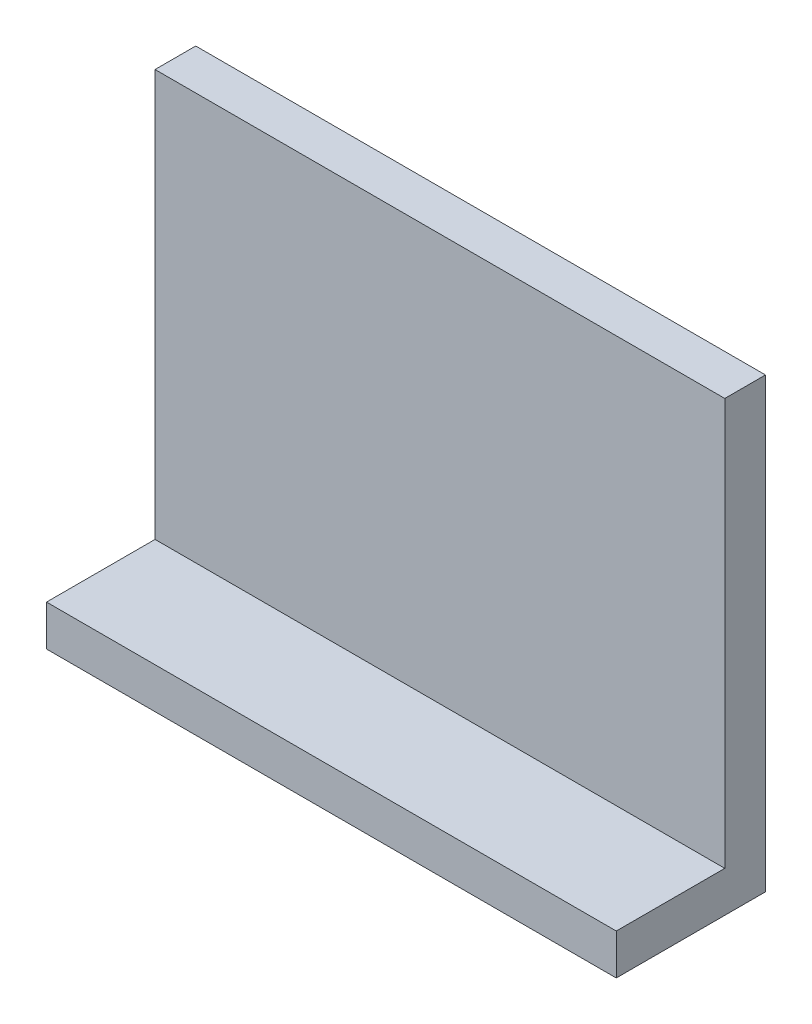
ISO-10303-21;
HEADER;
FILE_DESCRIPTION(('STEP AP214'),'2;1');
FILE_NAME('part.step','',(''),(''),'','','');
FILE_SCHEMA(('AUTOMOTIVE_DESIGN { 1 0 10303 214 1 1 1 1 }'));
ENDSEC;
DATA;
#1=APPLICATION_CONTEXT('core data for automotive mechanical design processes');
#2=APPLICATION_PROTOCOL_DEFINITION('international standard','automotive_design',2000,#1);
#3=PRODUCT_CONTEXT('',#1,'mechanical');
#4=PRODUCT('Part','Part','',(#3));
#5=PRODUCT_RELATED_PRODUCT_CATEGORY('part','',(#4));
#6=PRODUCT_DEFINITION_FORMATION('','',#4);
#7=PRODUCT_DEFINITION_CONTEXT('part definition',#1,'design');
#8=PRODUCT_DEFINITION('design','',#6,#7);
#9=PRODUCT_DEFINITION_SHAPE('','',#8);
#10=(LENGTH_UNIT() NAMED_UNIT(*) SI_UNIT(.MILLI.,.METRE.));
#11=(NAMED_UNIT(*) PLANE_ANGLE_UNIT() SI_UNIT($,.RADIAN.));
#12=(NAMED_UNIT(*) SI_UNIT($,.STERADIAN.) SOLID_ANGLE_UNIT());
#13=UNCERTAINTY_MEASURE_WITH_UNIT(LENGTH_MEASURE(1.E-05),#10,'distance_accuracy_value','');
#14=(GEOMETRIC_REPRESENTATION_CONTEXT(3) GLOBAL_UNCERTAINTY_ASSIGNED_CONTEXT((#13)) GLOBAL_UNIT_ASSIGNED_CONTEXT((#10,
#11,#12)) REPRESENTATION_CONTEXT('',''));
#15=CARTESIAN_POINT('',(0.,0.,0.));
#16=DIRECTION('',(0.,0.,1.));
#17=DIRECTION('',(1.,0.,0.));
#18=AXIS2_PLACEMENT_3D('',#15,#16,#17);
#19=CARTESIAN_POINT('',(0.,0.,3.));
#20=DIRECTION('',(0.,0.,-1.));
#21=DIRECTION('',(-1.,0.,0.));
#22=AXIS2_PLACEMENT_3D('',#19,#20,#21);
#23=PLANE('',#22);
#24=DIRECTION('',(-1.,0.,0.));
#25=VECTOR('',#24,1.);
#26=CARTESIAN_POINT('',(0.,3.,3.));
#27=LINE('',#26,#25);
#28=CARTESIAN_POINT('',(42.,3.,3.));
#29=VERTEX_POINT('',#28);
#30=CARTESIAN_POINT('',(0.,3.,3.));
#31=VERTEX_POINT('',#30);
#32=EDGE_CURVE('E50',#29,#31,#27,.T.);
#33=ORIENTED_EDGE('',*,*,#32,.F.);
#34=DIRECTION('',(0.,1.,0.));
#35=VECTOR('',#34,1.);
#36=CARTESIAN_POINT('',(42.,0.,3.));
#37=LINE('',#36,#35);
#38=CARTESIAN_POINT('',(42.,33.,3.));
#39=VERTEX_POINT('',#38);
#40=EDGE_CURVE('E137',#29,#39,#37,.T.);
#41=ORIENTED_EDGE('',*,*,#40,.T.);
#42=DIRECTION('',(-1.,0.,0.));
#43=VECTOR('',#42,1.);
#44=CARTESIAN_POINT('',(0.,33.,3.));
#45=LINE('',#44,#43);
#46=CARTESIAN_POINT('',(0.,33.,3.));
#47=VERTEX_POINT('',#46);
#48=EDGE_CURVE('E56',#39,#47,#45,.T.);
#49=ORIENTED_EDGE('',*,*,#48,.T.);
#50=DIRECTION('',(0.,-1.,0.));
#51=VECTOR('',#50,1.);
#52=CARTESIAN_POINT('',(0.,0.,3.));
#53=LINE('',#52,#51);
#54=EDGE_CURVE('E85',#47,#31,#53,.T.);
#55=ORIENTED_EDGE('',*,*,#54,.T.);
#56=EDGE_LOOP('',(#33,#41,#49,#55));
#57=FACE_BOUND('',#56,.T.);
#58=ADVANCED_FACE('F35',(#57),#23,.F.);
#59=CARTESIAN_POINT('',(0.,0.,3.));
#60=DIRECTION('',(1.,0.,0.));
#61=DIRECTION('',(0.,0.,-1.));
#62=AXIS2_PLACEMENT_3D('',#59,#60,#61);
#63=PLANE('',#62);
#64=DIRECTION('',(0.,-1.,0.));
#65=VECTOR('',#64,1.);
#66=CARTESIAN_POINT('',(0.,0.,0.));
#67=LINE('',#66,#65);
#68=CARTESIAN_POINT('',(0.,33.,0.));
#69=VERTEX_POINT('',#68);
#70=CARTESIAN_POINT('',(0.,0.,0.));
#71=VERTEX_POINT('',#70);
#72=EDGE_CURVE('E91',#69,#71,#67,.T.);
#73=ORIENTED_EDGE('',*,*,#72,.T.);
#74=DIRECTION('',(0.,0.,-1.));
#75=VECTOR('',#74,1.);
#76=CARTESIAN_POINT('',(0.,0.,3.));
#77=LINE('',#76,#75);
#78=CARTESIAN_POINT('',(0.,0.,11.));
#79=VERTEX_POINT('',#78);
#80=EDGE_CURVE('E11',#79,#71,#77,.T.);
#81=ORIENTED_EDGE('',*,*,#80,.F.);
#82=DIRECTION('',(0.,-1.,0.));
#83=VECTOR('',#82,1.);
#84=CARTESIAN_POINT('',(0.,0.,11.));
#85=LINE('',#84,#83);
#86=CARTESIAN_POINT('',(0.,3.,11.));
#87=VERTEX_POINT('',#86);
#88=EDGE_CURVE('E128',#87,#79,#85,.T.);
#89=ORIENTED_EDGE('',*,*,#88,.F.);
#90=DIRECTION('',(0.,0.,-1.));
#91=VECTOR('',#90,1.);
#92=CARTESIAN_POINT('',(0.,3.,11.));
#93=LINE('',#92,#91);
#94=EDGE_CURVE('E100',#87,#31,#93,.T.);
#95=ORIENTED_EDGE('',*,*,#94,.T.);
#96=ORIENTED_EDGE('',*,*,#54,.F.);
#97=DIRECTION('',(0.,0.,-1.));
#98=VECTOR('',#97,1.);
#99=CARTESIAN_POINT('',(0.,33.,3.));
#100=LINE('',#99,#98);
#101=EDGE_CURVE('E78',#47,#69,#100,.T.);
#102=ORIENTED_EDGE('',*,*,#101,.T.);
#103=EDGE_LOOP('',(#73,#81,#89,#95,#96,#102));
#104=FACE_BOUND('',#103,.T.);
#105=ADVANCED_FACE('F37',(#104),#63,.F.);
#106=CARTESIAN_POINT('',(0.,0.,3.));
#107=DIRECTION('',(0.,1.,0.));
#108=DIRECTION('',(0.,0.,1.));
#109=AXIS2_PLACEMENT_3D('',#106,#107,#108);
#110=PLANE('',#109);
#111=DIRECTION('',(1.,0.,0.));
#112=VECTOR('',#111,1.);
#113=CARTESIAN_POINT('',(0.,0.,0.));
#114=LINE('',#113,#112);
#115=CARTESIAN_POINT('',(42.,0.,0.));
#116=VERTEX_POINT('',#115);
#117=EDGE_CURVE('E95',#71,#116,#114,.T.);
#118=ORIENTED_EDGE('',*,*,#117,.T.);
#119=DIRECTION('',(0.,0.,-1.));
#120=VECTOR('',#119,1.);
#121=CARTESIAN_POINT('',(42.,0.,3.));
#122=LINE('',#121,#120);
#123=CARTESIAN_POINT('',(42.,0.,11.));
#124=VERTEX_POINT('',#123);
#125=EDGE_CURVE('E43',#124,#116,#122,.T.);
#126=ORIENTED_EDGE('',*,*,#125,.F.);
#127=DIRECTION('',(1.,0.,0.));
#128=VECTOR('',#127,1.);
#129=CARTESIAN_POINT('',(0.,0.,11.));
#130=LINE('',#129,#128);
#131=EDGE_CURVE('E120',#79,#124,#130,.T.);
#132=ORIENTED_EDGE('',*,*,#131,.F.);
#133=ORIENTED_EDGE('',*,*,#80,.T.);
#134=EDGE_LOOP('',(#118,#126,#132,#133));
#135=FACE_BOUND('',#134,.T.);
#136=ADVANCED_FACE('F118',(#135),#110,.F.);
#137=CARTESIAN_POINT('',(42.,0.,3.));
#138=DIRECTION('',(-1.,0.,0.));
#139=DIRECTION('',(0.,0.,1.));
#140=AXIS2_PLACEMENT_3D('',#137,#138,#139);
#141=PLANE('',#140);
#142=DIRECTION('',(0.,1.,0.));
#143=VECTOR('',#142,1.);
#144=CARTESIAN_POINT('',(42.,0.,0.));
#145=LINE('',#144,#143);
#146=CARTESIAN_POINT('',(42.,33.,0.));
#147=VERTEX_POINT('',#146);
#148=EDGE_CURVE('E86',#116,#147,#145,.T.);
#149=ORIENTED_EDGE('',*,*,#148,.T.);
#150=DIRECTION('',(0.,0.,-1.));
#151=VECTOR('',#150,1.);
#152=CARTESIAN_POINT('',(42.,33.,3.));
#153=LINE('',#152,#151);
#154=EDGE_CURVE('E81',#39,#147,#153,.T.);
#155=ORIENTED_EDGE('',*,*,#154,.F.);
#156=ORIENTED_EDGE('',*,*,#40,.F.);
#157=DIRECTION('',(0.,0.,-1.));
#158=VECTOR('',#157,1.);
#159=CARTESIAN_POINT('',(42.,3.,11.));
#160=LINE('',#159,#158);
#161=CARTESIAN_POINT('',(42.,3.,11.));
#162=VERTEX_POINT('',#161);
#163=EDGE_CURVE('E96',#162,#29,#160,.T.);
#164=ORIENTED_EDGE('',*,*,#163,.F.);
#165=DIRECTION('',(0.,1.,0.));
#166=VECTOR('',#165,1.);
#167=CARTESIAN_POINT('',(42.,0.,11.));
#168=LINE('',#167,#166);
#169=EDGE_CURVE('E114',#124,#162,#168,.T.);
#170=ORIENTED_EDGE('',*,*,#169,.F.);
#171=ORIENTED_EDGE('',*,*,#125,.T.);
#172=EDGE_LOOP('',(#149,#155,#156,#164,#170,#171));
#173=FACE_BOUND('',#172,.T.);
#174=ADVANCED_FACE('F110',(#173),#141,.F.);
#175=CARTESIAN_POINT('',(0.,33.,3.));
#176=DIRECTION('',(0.,-1.,0.));
#177=DIRECTION('',(0.,0.,-1.));
#178=AXIS2_PLACEMENT_3D('',#175,#176,#177);
#179=PLANE('',#178);
#180=DIRECTION('',(-1.,0.,0.));
#181=VECTOR('',#180,1.);
#182=CARTESIAN_POINT('',(0.,33.,0.));
#183=LINE('',#182,#181);
#184=EDGE_CURVE('E75',#147,#69,#183,.T.);
#185=ORIENTED_EDGE('',*,*,#184,.T.);
#186=ORIENTED_EDGE('',*,*,#101,.F.);
#187=ORIENTED_EDGE('',*,*,#48,.F.);
#188=ORIENTED_EDGE('',*,*,#154,.T.);
#189=EDGE_LOOP('',(#185,#186,#187,#188));
#190=FACE_BOUND('',#189,.T.);
#191=ADVANCED_FACE('F77',(#190),#179,.F.);
#192=CARTESIAN_POINT('',(0.,0.,0.));
#193=DIRECTION('',(0.,0.,-1.));
#194=DIRECTION('',(-1.,0.,0.));
#195=AXIS2_PLACEMENT_3D('',#192,#193,#194);
#196=PLANE('',#195);
#197=ORIENTED_EDGE('',*,*,#72,.F.);
#198=ORIENTED_EDGE('',*,*,#184,.F.);
#199=ORIENTED_EDGE('',*,*,#148,.F.);
#200=ORIENTED_EDGE('',*,*,#117,.F.);
#201=EDGE_LOOP('',(#197,#198,#199,#200));
#202=FACE_BOUND('',#201,.T.);
#203=ADVANCED_FACE('F94',(#202),#196,.T.);
#204=CARTESIAN_POINT('',(0.,3.,11.));
#205=DIRECTION('',(0.,-1.,0.));
#206=DIRECTION('',(0.,0.,-1.));
#207=AXIS2_PLACEMENT_3D('',#204,#205,#206);
#208=PLANE('',#207);
#209=ORIENTED_EDGE('',*,*,#32,.T.);
#210=ORIENTED_EDGE('',*,*,#94,.F.);
#211=DIRECTION('',(-1.,0.,0.));
#212=VECTOR('',#211,1.);
#213=CARTESIAN_POINT('',(0.,3.,11.));
#214=LINE('',#213,#212);
#215=EDGE_CURVE('E130',#162,#87,#214,.T.);
#216=ORIENTED_EDGE('',*,*,#215,.F.);
#217=ORIENTED_EDGE('',*,*,#163,.T.);
#218=EDGE_LOOP('',(#209,#210,#216,#217));
#219=FACE_BOUND('',#218,.T.);
#220=ADVANCED_FACE('F140',(#219),#208,.F.);
#221=CARTESIAN_POINT('',(0.,0.,11.));
#222=DIRECTION('',(0.,0.,-1.));
#223=DIRECTION('',(-1.,0.,0.));
#224=AXIS2_PLACEMENT_3D('',#221,#222,#223);
#225=PLANE('',#224);
#226=ORIENTED_EDGE('',*,*,#88,.T.);
#227=ORIENTED_EDGE('',*,*,#131,.T.);
#228=ORIENTED_EDGE('',*,*,#169,.T.);
#229=ORIENTED_EDGE('',*,*,#215,.T.);
#230=EDGE_LOOP('',(#226,#227,#228,#229));
#231=FACE_BOUND('',#230,.T.);
#232=ADVANCED_FACE('F125',(#231),#225,.F.);
#233=CLOSED_SHELL('',(#58,#105,#136,#174,#191,#203,#220,#232));
#234=MANIFOLD_SOLID_BREP('B2',#233);
#235=ADVANCED_BREP_SHAPE_REPRESENTATION('',(#18,#234),#14);
#236=SHAPE_DEFINITION_REPRESENTATION(#9,#235);
ENDSEC;
END-ISO-10303-21;
